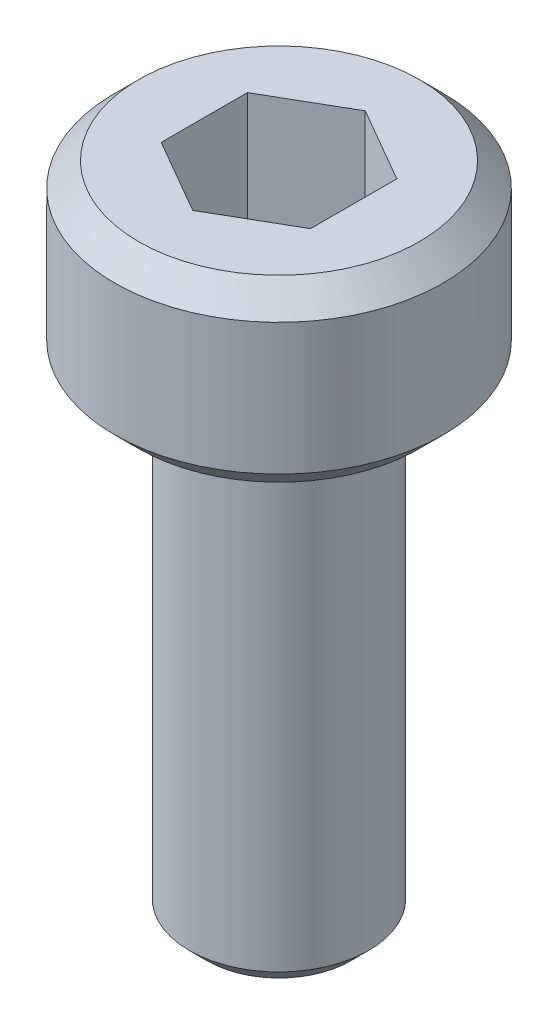
ISO-10303-21;
HEADER;
FILE_DESCRIPTION(('STEP AP214'),'2;1');
FILE_NAME('part.step','',(''),(''),'','','');
FILE_SCHEMA(('AUTOMOTIVE_DESIGN { 1 0 10303 214 1 1 1 1 }'));
ENDSEC;
DATA;
#1=APPLICATION_CONTEXT('core data for automotive mechanical design processes');
#2=APPLICATION_PROTOCOL_DEFINITION('international standard','automotive_design',2000,#1);
#3=PRODUCT_CONTEXT('',#1,'mechanical');
#4=PRODUCT('Part','Part','',(#3));
#5=PRODUCT_RELATED_PRODUCT_CATEGORY('part','',(#4));
#6=PRODUCT_DEFINITION_FORMATION('','',#4);
#7=PRODUCT_DEFINITION_CONTEXT('part definition',#1,'design');
#8=PRODUCT_DEFINITION('design','',#6,#7);
#9=PRODUCT_DEFINITION_SHAPE('','',#8);
#10=(LENGTH_UNIT() NAMED_UNIT(*) SI_UNIT(.MILLI.,.METRE.));
#11=(NAMED_UNIT(*) PLANE_ANGLE_UNIT() SI_UNIT($,.RADIAN.));
#12=(NAMED_UNIT(*) SI_UNIT($,.STERADIAN.) SOLID_ANGLE_UNIT());
#13=UNCERTAINTY_MEASURE_WITH_UNIT(LENGTH_MEASURE(1.E-05),#10,'distance_accuracy_value','');
#14=(GEOMETRIC_REPRESENTATION_CONTEXT(3) GLOBAL_UNCERTAINTY_ASSIGNED_CONTEXT((#13)) GLOBAL_UNIT_ASSIGNED_CONTEXT((#10,
#11,#12)) REPRESENTATION_CONTEXT('',''));
#15=CARTESIAN_POINT('',(0.,0.,0.));
#16=DIRECTION('',(0.,0.,1.));
#17=DIRECTION('',(1.,0.,0.));
#18=AXIS2_PLACEMENT_3D('',#15,#16,#17);
#19=CARTESIAN_POINT('',(0.,1.,-1.44337567297406));
#20=DIRECTION('',(-0.5,0.,-0.866025403784438));
#21=DIRECTION('',(-0.866025403784438,0.,0.5));
#22=AXIS2_PLACEMENT_3D('',#19,#20,#21);
#23=PLANE('',#22);
#24=DIRECTION('',(0.,1.,0.));
#25=VECTOR('',#24,1.);
#26=CARTESIAN_POINT('',(-1.25,1.,-0.721687836487031));
#27=LINE('',#26,#25);
#28=CARTESIAN_POINT('',(-1.25,3.,-0.721687836487031));
#29=VERTEX_POINT('',#28);
#30=CARTESIAN_POINT('',(-1.25,1.,-0.721687836487031));
#31=VERTEX_POINT('',#30);
#32=EDGE_CURVE('E82',#29,#31,#27,.F.);
#33=ORIENTED_EDGE('',*,*,#32,.T.);
#34=DIRECTION('',(-0.866025403784438,0.,0.5));
#35=VECTOR('',#34,1.);
#36=CARTESIAN_POINT('',(0.,1.,-1.44337567297406));
#37=LINE('',#36,#35);
#38=CARTESIAN_POINT('',(0.,1.,-1.44337567297406));
#39=VERTEX_POINT('',#38);
#40=EDGE_CURVE('E71',#39,#31,#37,.T.);
#41=ORIENTED_EDGE('',*,*,#40,.F.);
#42=DIRECTION('',(0.,1.,0.));
#43=VECTOR('',#42,1.);
#44=CARTESIAN_POINT('',(0.,1.,-1.44337567297406));
#45=LINE('',#44,#43);
#46=CARTESIAN_POINT('',(0.,3.,-1.44337567297406));
#47=VERTEX_POINT('',#46);
#48=EDGE_CURVE('E91',#39,#47,#45,.T.);
#49=ORIENTED_EDGE('',*,*,#48,.T.);
#50=DIRECTION('',(-0.866025403784438,0.,0.5));
#51=VECTOR('',#50,1.);
#52=CARTESIAN_POINT('',(0.,3.,-1.44337567297406));
#53=LINE('',#52,#51);
#54=EDGE_CURVE('E66',#29,#47,#53,.F.);
#55=ORIENTED_EDGE('',*,*,#54,.F.);
#56=EDGE_LOOP('',(#33,#41,#49,#55));
#57=FACE_BOUND('',#56,.T.);
#58=ADVANCED_FACE('F16',(#57),#23,.F.);
#59=CARTESIAN_POINT('',(-1.25,1.,-0.721687836487031));
#60=DIRECTION('',(-1.,0.,0.));
#61=DIRECTION('',(0.,0.,1.));
#62=AXIS2_PLACEMENT_3D('',#59,#60,#61);
#63=PLANE('',#62);
#64=DIRECTION('',(0.,1.,0.));
#65=VECTOR('',#64,1.);
#66=CARTESIAN_POINT('',(-1.25,1.,0.721687836487033));
#67=LINE('',#66,#65);
#68=CARTESIAN_POINT('',(-1.25,3.,0.721687836487033));
#69=VERTEX_POINT('',#68);
#70=CARTESIAN_POINT('',(-1.25,1.,0.721687836487033));
#71=VERTEX_POINT('',#70);
#72=EDGE_CURVE('E87',#69,#71,#67,.F.);
#73=ORIENTED_EDGE('',*,*,#72,.T.);
#74=DIRECTION('',(0.,0.,1.));
#75=VECTOR('',#74,1.);
#76=CARTESIAN_POINT('',(-1.25,1.,-0.721687836487031));
#77=LINE('',#76,#75);
#78=EDGE_CURVE('E75',#31,#71,#77,.T.);
#79=ORIENTED_EDGE('',*,*,#78,.F.);
#80=ORIENTED_EDGE('',*,*,#32,.F.);
#81=DIRECTION('',(0.,0.,1.));
#82=VECTOR('',#81,1.);
#83=CARTESIAN_POINT('',(-1.25,3.,-0.721687836487031));
#84=LINE('',#83,#82);
#85=EDGE_CURVE('E89',#69,#29,#84,.F.);
#86=ORIENTED_EDGE('',*,*,#85,.F.);
#87=EDGE_LOOP('',(#73,#79,#80,#86));
#88=FACE_BOUND('',#87,.T.);
#89=ADVANCED_FACE('F85',(#88),#63,.F.);
#90=CARTESIAN_POINT('',(1.25,1.,-0.721687836487032));
#91=DIRECTION('',(0.5,0.,-0.866025403784439));
#92=DIRECTION('',(-0.866025403784439,0.,-0.5));
#93=AXIS2_PLACEMENT_3D('',#90,#91,#92);
#94=PLANE('',#93);
#95=ORIENTED_EDGE('',*,*,#48,.F.);
#96=DIRECTION('',(-0.866025403784439,0.,-0.5));
#97=VECTOR('',#96,1.);
#98=CARTESIAN_POINT('',(1.25,1.,-0.721687836487032));
#99=LINE('',#98,#97);
#100=CARTESIAN_POINT('',(1.25,1.,-0.721687836487032));
#101=VERTEX_POINT('',#100);
#102=EDGE_CURVE('E78',#101,#39,#99,.T.);
#103=ORIENTED_EDGE('',*,*,#102,.F.);
#104=DIRECTION('',(0.,1.,0.));
#105=VECTOR('',#104,1.);
#106=CARTESIAN_POINT('',(1.25,1.,-0.721687836487032));
#107=LINE('',#106,#105);
#108=CARTESIAN_POINT('',(1.25,3.,-0.721687836487032));
#109=VERTEX_POINT('',#108);
#110=EDGE_CURVE('E121',#101,#109,#107,.T.);
#111=ORIENTED_EDGE('',*,*,#110,.T.);
#112=DIRECTION('',(-0.866025403784439,0.,-0.5));
#113=VECTOR('',#112,1.);
#114=CARTESIAN_POINT('',(1.25,3.,-0.721687836487032));
#115=LINE('',#114,#113);
#116=EDGE_CURVE('E133',#47,#109,#115,.F.);
#117=ORIENTED_EDGE('',*,*,#116,.F.);
#118=EDGE_LOOP('',(#95,#103,#111,#117));
#119=FACE_BOUND('',#118,.T.);
#120=ADVANCED_FACE('F136',(#119),#94,.F.);
#121=CARTESIAN_POINT('',(-1.25,1.,0.721687836487033));
#122=DIRECTION('',(-0.499999999999999,0.,0.866025403784439));
#123=DIRECTION('',(0.866025403784439,0.,0.499999999999999));
#124=AXIS2_PLACEMENT_3D('',#121,#122,#123);
#125=PLANE('',#124);
#126=DIRECTION('',(0.,1.,0.));
#127=VECTOR('',#126,1.);
#128=CARTESIAN_POINT('',(0.,1.,1.44337567297406));
#129=LINE('',#128,#127);
#130=CARTESIAN_POINT('',(0.,3.,1.44337567297406));
#131=VERTEX_POINT('',#130);
#132=CARTESIAN_POINT('',(0.,1.,1.44337567297406));
#133=VERTEX_POINT('',#132);
#134=EDGE_CURVE('E118',#131,#133,#129,.F.);
#135=ORIENTED_EDGE('',*,*,#134,.T.);
#136=DIRECTION('',(0.866025403784439,0.,0.499999999999999));
#137=VECTOR('',#136,1.);
#138=CARTESIAN_POINT('',(-1.25,1.,0.721687836487033));
#139=LINE('',#138,#137);
#140=EDGE_CURVE('E127',#71,#133,#139,.T.);
#141=ORIENTED_EDGE('',*,*,#140,.F.);
#142=ORIENTED_EDGE('',*,*,#72,.F.);
#143=DIRECTION('',(0.866025403784439,0.,0.499999999999999));
#144=VECTOR('',#143,1.);
#145=CARTESIAN_POINT('',(-1.25,3.,0.721687836487033));
#146=LINE('',#145,#144);
#147=EDGE_CURVE('E129',#131,#69,#146,.F.);
#148=ORIENTED_EDGE('',*,*,#147,.F.);
#149=EDGE_LOOP('',(#135,#141,#142,#148));
#150=FACE_BOUND('',#149,.T.);
#151=ADVANCED_FACE('F143',(#150),#125,.F.);
#152=CARTESIAN_POINT('',(1.25,1.,2.1650635094611));
#153=DIRECTION('',(0.,1.,0.));
#154=DIRECTION('',(0.,0.,1.));
#155=AXIS2_PLACEMENT_3D('',#152,#153,#154);
#156=PLANE('',#155);
#157=ORIENTED_EDGE('',*,*,#40,.T.);
#158=ORIENTED_EDGE('',*,*,#78,.T.);
#159=ORIENTED_EDGE('',*,*,#140,.T.);
#160=DIRECTION('',(0.866025403784438,0.,-0.5));
#161=VECTOR('',#160,1.);
#162=CARTESIAN_POINT('',(0.,1.,1.44337567297406));
#163=LINE('',#162,#161);
#164=CARTESIAN_POINT('',(1.25,1.,0.721687836487031));
#165=VERTEX_POINT('',#164);
#166=EDGE_CURVE('E116',#133,#165,#163,.T.);
#167=ORIENTED_EDGE('',*,*,#166,.T.);
#168=DIRECTION('',(0.,0.,-1.));
#169=VECTOR('',#168,1.);
#170=CARTESIAN_POINT('',(1.25,1.,0.721687836487031));
#171=LINE('',#170,#169);
#172=EDGE_CURVE('E124',#165,#101,#171,.T.);
#173=ORIENTED_EDGE('',*,*,#172,.T.);
#174=ORIENTED_EDGE('',*,*,#102,.T.);
#175=EDGE_LOOP('',(#157,#158,#159,#167,#173,#174));
#176=FACE_BOUND('',#175,.T.);
#177=ADVANCED_FACE('F72',(#176),#156,.T.);
#178=CARTESIAN_POINT('',(1.25,1.,0.721687836487031));
#179=DIRECTION('',(1.,0.,0.));
#180=DIRECTION('',(0.,0.,-1.));
#181=AXIS2_PLACEMENT_3D('',#178,#179,#180);
#182=PLANE('',#181);
#183=ORIENTED_EDGE('',*,*,#110,.F.);
#184=ORIENTED_EDGE('',*,*,#172,.F.);
#185=DIRECTION('',(0.,1.,0.));
#186=VECTOR('',#185,1.);
#187=CARTESIAN_POINT('',(1.25,1.,0.721687836487031));
#188=LINE('',#187,#186);
#189=CARTESIAN_POINT('',(1.25,3.,0.721687836487031));
#190=VERTEX_POINT('',#189);
#191=EDGE_CURVE('E114',#165,#190,#188,.T.);
#192=ORIENTED_EDGE('',*,*,#191,.T.);
#193=DIRECTION('',(0.,0.,-1.));
#194=VECTOR('',#193,1.);
#195=CARTESIAN_POINT('',(1.25,3.,0.721687836487031));
#196=LINE('',#195,#194);
#197=EDGE_CURVE('E34',#109,#190,#196,.F.);
#198=ORIENTED_EDGE('',*,*,#197,.F.);
#199=EDGE_LOOP('',(#183,#184,#192,#198));
#200=FACE_BOUND('',#199,.T.);
#201=ADVANCED_FACE('F150',(#200),#182,.F.);
#202=CARTESIAN_POINT('',(0.,1.,1.44337567297406));
#203=DIRECTION('',(0.5,0.,0.866025403784438));
#204=DIRECTION('',(0.866025403784438,0.,-0.5));
#205=AXIS2_PLACEMENT_3D('',#202,#203,#204);
#206=PLANE('',#205);
#207=ORIENTED_EDGE('',*,*,#191,.F.);
#208=ORIENTED_EDGE('',*,*,#166,.F.);
#209=ORIENTED_EDGE('',*,*,#134,.F.);
#210=DIRECTION('',(-0.866025403784438,0.,0.500000000000001));
#211=VECTOR('',#210,1.);
#212=CARTESIAN_POINT('',(1.25,3.,0.721687836487031));
#213=LINE('',#212,#211);
#214=EDGE_CURVE('E112',#190,#131,#213,.T.);
#215=ORIENTED_EDGE('',*,*,#214,.F.);
#216=EDGE_LOOP('',(#207,#208,#209,#215));
#217=FACE_BOUND('',#216,.T.);
#218=ADVANCED_FACE('F148',(#217),#206,.F.);
#219=CARTESIAN_POINT('',(0.,3.,0.));
#220=DIRECTION('',(0.,1.,0.));
#221=DIRECTION('',(0.,0.,1.));
#222=AXIS2_PLACEMENT_3D('',#219,#220,#221);
#223=PLANE('',#222);
#224=ORIENTED_EDGE('',*,*,#197,.T.);
#225=ORIENTED_EDGE('',*,*,#214,.T.);
#226=ORIENTED_EDGE('',*,*,#147,.T.);
#227=ORIENTED_EDGE('',*,*,#85,.T.);
#228=ORIENTED_EDGE('',*,*,#54,.T.);
#229=ORIENTED_EDGE('',*,*,#116,.T.);
#230=EDGE_LOOP('',(#224,#225,#226,#227,#228,#229));
#231=FACE_BOUND('',#230,.T.);
#232=CARTESIAN_POINT('',(0.,2.9999999999859,0.));
#233=DIRECTION('',(0.,-1.,0.));
#234=DIRECTION('',(0.,0.,-1.));
#235=AXIS2_PLACEMENT_3D('',#232,#233,#234);
#236=CIRCLE('',#235,2.35000000003538);
#237=CARTESIAN_POINT('',(0.,2.9999999999859,-2.35000000003538));
#238=VERTEX_POINT('',#237);
#239=EDGE_CURVE('E19',#238,#238,#236,.T.);
#240=ORIENTED_EDGE('',*,*,#239,.F.);
#241=EDGE_LOOP('',(#240));
#242=FACE_BOUND('',#241,.T.);
#243=ADVANCED_FACE('F138',(#231,#242),#223,.T.);
#244=CARTESIAN_POINT('',(0.,2.59999999991578,0.));
#245=DIRECTION('',(0.,-1.,0.));
#246=DIRECTION('',(0.,0.,-1.));
#247=AXIS2_PLACEMENT_3D('',#244,#245,#246);
#248=CONICAL_SURFACE('',#247,2.7500000001055,0.785398163397448);
#249=ORIENTED_EDGE('',*,*,#239,.T.);
#250=EDGE_LOOP('',(#249));
#251=FACE_BOUND('',#250,.T.);
#252=CARTESIAN_POINT('',(0.,2.6,0.));
#253=DIRECTION('',(0.,-1.,0.));
#254=DIRECTION('',(0.,0.,-1.));
#255=AXIS2_PLACEMENT_3D('',#252,#253,#254);
#256=CIRCLE('',#255,2.75);
#257=CARTESIAN_POINT('',(0.,2.6,-2.75));
#258=VERTEX_POINT('',#257);
#259=EDGE_CURVE('E104',#258,#258,#256,.T.);
#260=ORIENTED_EDGE('',*,*,#259,.F.);
#261=EDGE_LOOP('',(#260));
#262=FACE_BOUND('',#261,.T.);
#263=ADVANCED_FACE('F187',(#251,#262),#248,.T.);
#264=CARTESIAN_POINT('',(0.,3.,0.));
#265=DIRECTION('',(0.,-1.,0.));
#266=DIRECTION('',(0.,0.,-1.));
#267=AXIS2_PLACEMENT_3D('',#264,#265,#266);
#268=CYLINDRICAL_SURFACE('',#267,2.75);
#269=ORIENTED_EDGE('',*,*,#259,.T.);
#270=EDGE_LOOP('',(#269));
#271=FACE_BOUND('',#270,.T.);
#272=CARTESIAN_POINT('',(0.,0.400000000013279,0.));
#273=DIRECTION('',(0.,1.,0.));
#274=DIRECTION('',(0.,0.,1.));
#275=AXIS2_PLACEMENT_3D('',#272,#273,#274);
#276=CIRCLE('',#275,2.74999999999181);
#277=CARTESIAN_POINT('',(0.,0.400000000013279,2.74999999999181));
#278=VERTEX_POINT('',#277);
#279=EDGE_CURVE('E100',#278,#278,#276,.F.);
#280=ORIENTED_EDGE('',*,*,#279,.F.);
#281=EDGE_LOOP('',(#280));
#282=FACE_BOUND('',#281,.T.);
#283=ADVANCED_FACE('F183',(#271,#282),#268,.T.);
#284=CARTESIAN_POINT('',(0.,-8.,0.));
#285=DIRECTION('',(0.,1.,0.));
#286=DIRECTION('',(0.,0.,1.));
#287=AXIS2_PLACEMENT_3D('',#284,#285,#286);
#288=PLANE('',#287);
#289=CARTESIAN_POINT('',(0.,-7.99999999998136,0.));
#290=DIRECTION('',(0.,1.,0.));
#291=DIRECTION('',(0.,0.,1.));
#292=AXIS2_PLACEMENT_3D('',#289,#290,#291);
#293=CIRCLE('',#292,1.20000000009668);
#294=CARTESIAN_POINT('',(0.,-7.99999999998136,1.20000000009668));
#295=VERTEX_POINT('',#294);
#296=EDGE_CURVE('E98',#295,#295,#293,.T.);
#297=ORIENTED_EDGE('',*,*,#296,.F.);
#298=EDGE_LOOP('',(#297));
#299=FACE_BOUND('',#298,.T.);
#300=ADVANCED_FACE('F179',(#299),#288,.F.);
#301=CARTESIAN_POINT('',(0.,0.400000000013279,0.));
#302=DIRECTION('',(0.,1.,0.));
#303=DIRECTION('',(0.,0.,1.));
#304=AXIS2_PLACEMENT_3D('',#301,#302,#303);
#305=CONICAL_SURFACE('',#304,2.74999999999181,0.785398163397448);
#306=CARTESIAN_POINT('',(0.,0.,0.));
#307=DIRECTION('',(0.,1.,0.));
#308=DIRECTION('',(0.,0.,1.));
#309=AXIS2_PLACEMENT_3D('',#306,#307,#308);
#310=CIRCLE('',#309,2.34999999997854);
#311=CARTESIAN_POINT('',(0.,0.,2.34999999997854));
#312=VERTEX_POINT('',#311);
#313=EDGE_CURVE('E96',#312,#312,#310,.T.);
#314=ORIENTED_EDGE('',*,*,#313,.T.);
#315=EDGE_LOOP('',(#314));
#316=FACE_BOUND('',#315,.T.);
#317=ORIENTED_EDGE('',*,*,#279,.T.);
#318=EDGE_LOOP('',(#317));
#319=FACE_BOUND('',#318,.T.);
#320=ADVANCED_FACE('F175',(#316,#319),#305,.T.);
#321=CARTESIAN_POINT('',(0.,-7.7000000001135,0.));
#322=DIRECTION('',(0.,1.,0.));
#323=DIRECTION('',(0.,0.,1.));
#324=AXIS2_PLACEMENT_3D('',#321,#322,#323);
#325=CONICAL_SURFACE('',#324,1.49999999996453,0.785398163397448);
#326=CARTESIAN_POINT('',(0.,-7.7,0.));
#327=DIRECTION('',(0.,1.,0.));
#328=DIRECTION('',(0.,0.,1.));
#329=AXIS2_PLACEMENT_3D('',#326,#327,#328);
#330=CIRCLE('',#329,1.5);
#331=CARTESIAN_POINT('',(0.,-7.7,1.5));
#332=VERTEX_POINT('',#331);
#333=EDGE_CURVE('E25',#332,#332,#330,.T.);
#334=ORIENTED_EDGE('',*,*,#333,.F.);
#335=EDGE_LOOP('',(#334));
#336=FACE_BOUND('',#335,.T.);
#337=ORIENTED_EDGE('',*,*,#296,.T.);
#338=EDGE_LOOP('',(#337));
#339=FACE_BOUND('',#338,.T.);
#340=ADVANCED_FACE('F168',(#336,#339),#325,.T.);
#341=CARTESIAN_POINT('',(0.,0.,0.));
#342=DIRECTION('',(0.,1.,0.));
#343=DIRECTION('',(0.,0.,1.));
#344=AXIS2_PLACEMENT_3D('',#341,#342,#343);
#345=PLANE('',#344);
#346=CARTESIAN_POINT('',(0.,0.,0.));
#347=DIRECTION('',(0.,1.,0.));
#348=DIRECTION('',(0.,0.,1.));
#349=AXIS2_PLACEMENT_3D('',#346,#347,#348);
#350=CIRCLE('',#349,1.5);
#351=CARTESIAN_POINT('',(0.,0.,1.5));
#352=VERTEX_POINT('',#351);
#353=EDGE_CURVE('E11',#352,#352,#350,.F.);
#354=ORIENTED_EDGE('',*,*,#353,.F.);
#355=EDGE_LOOP('',(#354));
#356=FACE_BOUND('',#355,.T.);
#357=ORIENTED_EDGE('',*,*,#313,.F.);
#358=EDGE_LOOP('',(#357));
#359=FACE_BOUND('',#358,.T.);
#360=ADVANCED_FACE('F162',(#356,#359),#345,.F.);
#361=CARTESIAN_POINT('',(0.,-8.,0.));
#362=DIRECTION('',(0.,1.,0.));
#363=DIRECTION('',(0.,0.,1.));
#364=AXIS2_PLACEMENT_3D('',#361,#362,#363);
#365=CYLINDRICAL_SURFACE('',#364,1.5);
#366=ORIENTED_EDGE('',*,*,#353,.T.);
#367=EDGE_LOOP('',(#366));
#368=FACE_BOUND('',#367,.T.);
#369=ORIENTED_EDGE('',*,*,#333,.T.);
#370=EDGE_LOOP('',(#369));
#371=FACE_BOUND('',#370,.T.);
#372=ADVANCED_FACE('F160',(#368,#371),#365,.T.);
#373=CLOSED_SHELL('',(#58,#89,#120,#151,#177,#201,#218,#243,#263,#283,#300,#320,#340,#360,#372));
#374=MANIFOLD_SOLID_BREP('B1',#373);
#375=ADVANCED_BREP_SHAPE_REPRESENTATION('',(#18,#374),#14);
#376=SHAPE_DEFINITION_REPRESENTATION(#9,#375);
ENDSEC;
END-ISO-10303-21;
